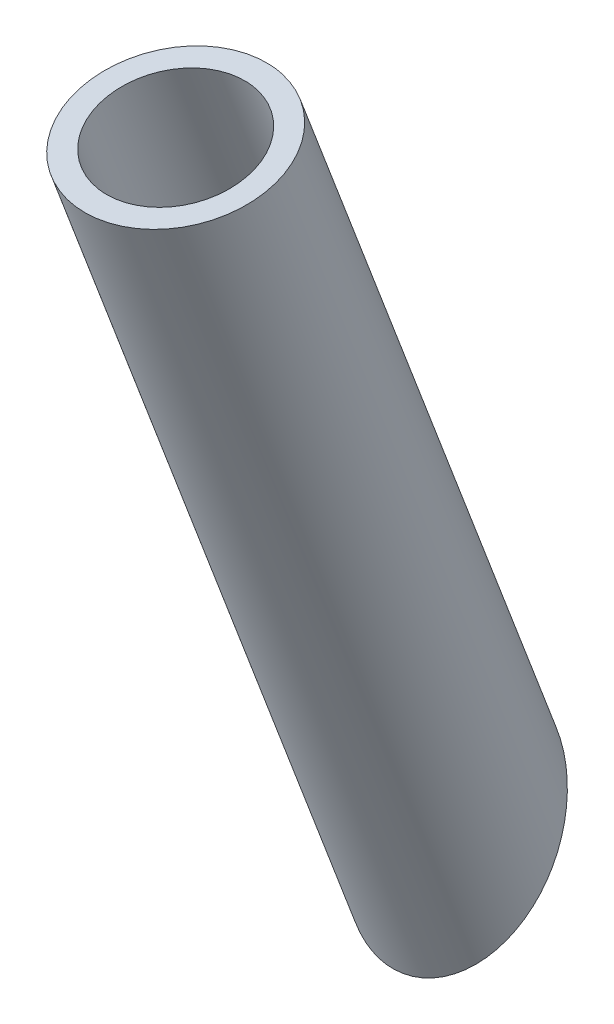
ISO-10303-21;
HEADER;
FILE_DESCRIPTION(('STEP AP214'),'2;1');
FILE_NAME('part.step','',(''),(''),'','','');
FILE_SCHEMA(('AUTOMOTIVE_DESIGN { 1 0 10303 214 1 1 1 1 }'));
ENDSEC;
DATA;
#1=APPLICATION_CONTEXT('core data for automotive mechanical design processes');
#2=APPLICATION_PROTOCOL_DEFINITION('international standard','automotive_design',2000,#1);
#3=PRODUCT_CONTEXT('',#1,'mechanical');
#4=PRODUCT('Part','Part','',(#3));
#5=PRODUCT_RELATED_PRODUCT_CATEGORY('part','',(#4));
#6=PRODUCT_DEFINITION_FORMATION('','',#4);
#7=PRODUCT_DEFINITION_CONTEXT('part definition',#1,'design');
#8=PRODUCT_DEFINITION('design','',#6,#7);
#9=PRODUCT_DEFINITION_SHAPE('','',#8);
#10=(LENGTH_UNIT() NAMED_UNIT(*) SI_UNIT(.MILLI.,.METRE.));
#11=(NAMED_UNIT(*) PLANE_ANGLE_UNIT() SI_UNIT($,.RADIAN.));
#12=(NAMED_UNIT(*) SI_UNIT($,.STERADIAN.) SOLID_ANGLE_UNIT());
#13=UNCERTAINTY_MEASURE_WITH_UNIT(LENGTH_MEASURE(1.E-05),#10,'distance_accuracy_value','');
#14=(GEOMETRIC_REPRESENTATION_CONTEXT(3) GLOBAL_UNCERTAINTY_ASSIGNED_CONTEXT((#13)) GLOBAL_UNIT_ASSIGNED_CONTEXT((#10,
#11,#12)) REPRESENTATION_CONTEXT('',''));
#15=CARTESIAN_POINT('',(0.,0.,0.));
#16=DIRECTION('',(0.,0.,1.));
#17=DIRECTION('',(1.,0.,0.));
#18=AXIS2_PLACEMENT_3D('',#15,#16,#17);
#19=CARTESIAN_POINT('',(899.196916053029,101.086343763392,238.011921297441));
#20=DIRECTION('',(0.00743596247195737,-0.935984664475876,-0.351962234235575));
#21=DIRECTION('',(0.,-0.35197196525769,0.936010542500799));
#22=AXIS2_PLACEMENT_3D('',#19,#20,#21);
#23=CYLINDRICAL_SURFACE('',#22,9.65000000000004);
#24=CARTESIAN_POINT('',(899.196916053029,101.086343763392,238.011921297441));
#25=DIRECTION('',(-0.00143638782424152,0.977156337317368,0.212516891635755));
#26=DIRECTION('',(0.0414428460712229,0.212392700268518,-0.976305193769943));
#27=AXIS2_PLACEMENT_3D('',#24,#25,#26);
#28=ELLIPSE('',#27,9.75326811540505,9.65000000000004);
#29=CARTESIAN_POINT('',(899.601119242227,103.157866714865,228.48975498014));
#30=VERTEX_POINT('',#29);
#31=EDGE_CURVE('E50',#30,#30,#28,.T.);
#32=ORIENTED_EDGE('',*,*,#31,.T.);
#33=EDGE_LOOP('',(#32));
#34=FACE_BOUND('',#33,.T.);
#35=CARTESIAN_POINT('',(900.,0.,200.));
#36=DIRECTION('',(-0.0045220973909886,0.569208602813942,0.822180708310397));
#37=DIRECTION('',(0.00653163689339619,-0.822154763312406,0.569226565509916));
#38=AXIS2_PLACEMENT_3D('',#35,#36,#37);
#39=ELLIPSE('',#38,11.7370790903511,9.65000000000004);
#40=CARTESIAN_POINT('',(900.076662338807,-9.64969548150654,206.681057219719));
#41=VERTEX_POINT('',#40);
#42=EDGE_CURVE('E45',#41,#41,#39,.T.);
#43=ORIENTED_EDGE('',*,*,#42,.F.);
#44=EDGE_LOOP('',(#43));
#45=FACE_BOUND('',#44,.T.);
#46=ADVANCED_FACE('F41',(#34,#45),#23,.F.);
#47=CARTESIAN_POINT('',(899.196916053029,101.086343763392,238.011921297441));
#48=DIRECTION('',(0.00743596247195737,-0.935984664475876,-0.351962234235575));
#49=DIRECTION('',(0.,-0.35197196525769,0.936010542500799));
#50=AXIS2_PLACEMENT_3D('',#47,#48,#49);
#51=CYLINDRICAL_SURFACE('',#50,12.7);
#52=CARTESIAN_POINT('',(899.196916053029,101.086343763392,238.011921297441));
#53=DIRECTION('',(-0.00143638782424152,0.977156337317368,0.212516891635755));
#54=DIRECTION('',(0.0414428460712229,0.212392700268518,-0.976305193769943));
#55=AXIS2_PLACEMENT_3D('',#52,#53,#54);
#56=ELLIPSE('',#55,12.8359072606885,12.7);
#57=CARTESIAN_POINT('',(899.728872581818,103.812596766886,225.480158372082));
#58=VERTEX_POINT('',#57);
#59=EDGE_CURVE('E56',#58,#58,#56,.T.);
#60=ORIENTED_EDGE('',*,*,#59,.F.);
#61=EDGE_LOOP('',(#60));
#62=FACE_BOUND('',#61,.T.);
#63=CARTESIAN_POINT('',(900.,0.,200.));
#64=DIRECTION('',(-0.0045220973909886,0.569208602813942,0.822180708310397));
#65=DIRECTION('',(0.00653163689339619,-0.822154763312406,0.569226565509916));
#66=AXIS2_PLACEMENT_3D('',#63,#64,#65);
#67=ELLIPSE('',#66,15.4467258494776,12.7);
#68=CARTESIAN_POINT('',(900.100892404441,-12.6995992347288,208.792686703671));
#69=VERTEX_POINT('',#68);
#70=EDGE_CURVE('E10',#69,#69,#67,.T.);
#71=ORIENTED_EDGE('',*,*,#70,.T.);
#72=EDGE_LOOP('',(#71));
#73=FACE_BOUND('',#72,.T.);
#74=ADVANCED_FACE('F72',(#62,#73),#51,.T.);
#75=CARTESIAN_POINT('',(899.196916053029,101.086343763392,238.011921297441));
#76=DIRECTION('',(0.00143638782424152,-0.977156337317368,-0.212516891635755));
#77=DIRECTION('',(0.,-0.21251711086958,0.977157345358283));
#78=AXIS2_PLACEMENT_3D('',#75,#76,#77);
#79=PLANE('',#78);
#80=ORIENTED_EDGE('',*,*,#31,.F.);
#81=EDGE_LOOP('',(#80));
#82=FACE_BOUND('',#81,.T.);
#83=ORIENTED_EDGE('',*,*,#59,.T.);
#84=EDGE_LOOP('',(#83));
#85=FACE_BOUND('',#84,.T.);
#86=ADVANCED_FACE('F78',(#82,#85),#79,.F.);
#87=CARTESIAN_POINT('',(900.,0.,200.));
#88=DIRECTION('',(0.0045220973909886,-0.569208602813942,-0.822180708310397));
#89=DIRECTION('',(0.,-0.822189114975954,0.569214422880393));
#90=AXIS2_PLACEMENT_3D('',#87,#88,#89);
#91=PLANE('',#90);
#92=ORIENTED_EDGE('',*,*,#42,.T.);
#93=EDGE_LOOP('',(#92));
#94=FACE_BOUND('',#93,.T.);
#95=ORIENTED_EDGE('',*,*,#70,.F.);
#96=EDGE_LOOP('',(#95));
#97=FACE_BOUND('',#96,.T.);
#98=ADVANCED_FACE('F43',(#94,#97),#91,.T.);
#99=CLOSED_SHELL('',(#46,#74,#86,#98));
#100=MANIFOLD_SOLID_BREP('B2',#99);
#101=ADVANCED_BREP_SHAPE_REPRESENTATION('',(#18,#100),#14);
#102=SHAPE_DEFINITION_REPRESENTATION(#9,#101);
ENDSEC;
END-ISO-10303-21;
